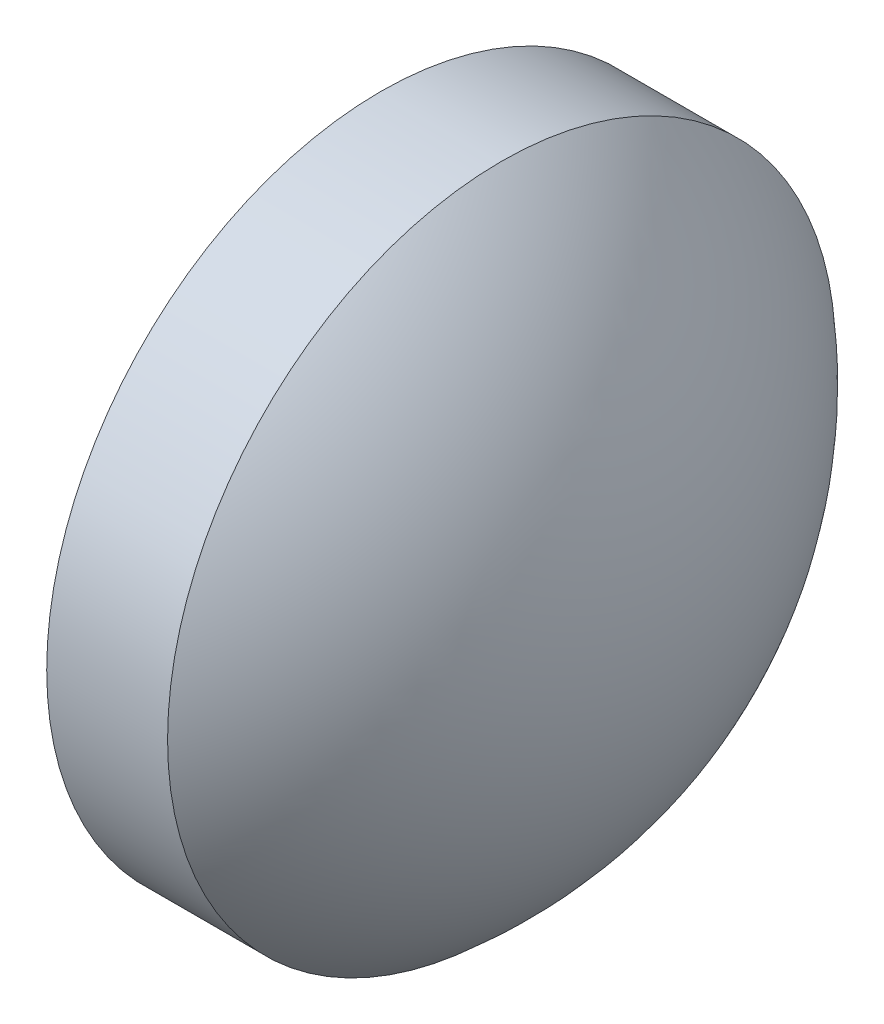
ISO-10303-21;
HEADER;
FILE_DESCRIPTION(('STEP AP214'),'2;1');
FILE_NAME('part.step','',(''),(''),'','','');
FILE_SCHEMA(('AUTOMOTIVE_DESIGN { 1 0 10303 214 1 1 1 1 }'));
ENDSEC;
DATA;
#1=APPLICATION_CONTEXT('core data for automotive mechanical design processes');
#2=APPLICATION_PROTOCOL_DEFINITION('international standard','automotive_design',2000,#1);
#3=PRODUCT_CONTEXT('',#1,'mechanical');
#4=PRODUCT('Part','Part','',(#3));
#5=PRODUCT_RELATED_PRODUCT_CATEGORY('part','',(#4));
#6=PRODUCT_DEFINITION_FORMATION('','',#4);
#7=PRODUCT_DEFINITION_CONTEXT('part definition',#1,'design');
#8=PRODUCT_DEFINITION('design','',#6,#7);
#9=PRODUCT_DEFINITION_SHAPE('','',#8);
#10=(LENGTH_UNIT() NAMED_UNIT(*) SI_UNIT(.MILLI.,.METRE.));
#11=(NAMED_UNIT(*) PLANE_ANGLE_UNIT() SI_UNIT($,.RADIAN.));
#12=(NAMED_UNIT(*) SI_UNIT($,.STERADIAN.) SOLID_ANGLE_UNIT());
#13=UNCERTAINTY_MEASURE_WITH_UNIT(LENGTH_MEASURE(1.E-05),#10,'distance_accuracy_value','');
#14=(GEOMETRIC_REPRESENTATION_CONTEXT(3) GLOBAL_UNCERTAINTY_ASSIGNED_CONTEXT((#13)) GLOBAL_UNIT_ASSIGNED_CONTEXT((#10,
#11,#12)) REPRESENTATION_CONTEXT('',''));
#15=CARTESIAN_POINT('',(0.,0.,0.));
#16=DIRECTION('',(0.,0.,1.));
#17=DIRECTION('',(1.,0.,0.));
#18=AXIS2_PLACEMENT_3D('',#15,#16,#17);
#19=CARTESIAN_POINT('',(428.801579864745,112.918675998957,0.));
#20=DIRECTION('',(-1.,0.,0.));
#21=DIRECTION('',(0.,1.,0.));
#22=AXIS2_PLACEMENT_3D('',#19,#20,#21);
#23=SPHERICAL_SURFACE('',#22,4.12811643835615);
#24=CARTESIAN_POINT('',(431.469696303101,112.918675998957,0.));
#25=DIRECTION('',(-1.,0.,0.));
#26=DIRECTION('',(0.,0.,1.));
#27=AXIS2_PLACEMENT_3D('',#24,#25,#26);
#28=CIRCLE('',#27,3.15000000000001);
#29=CARTESIAN_POINT('',(431.469696303101,112.918675998957,3.15000000000001));
#30=VERTEX_POINT('',#29);
#31=EDGE_CURVE('E10',#30,#30,#28,.T.);
#32=ORIENTED_EDGE('',*,*,#31,.F.);
#33=EDGE_LOOP('',(#32));
#34=FACE_BOUND('',#33,.T.);
#35=ADVANCED_FACE('F35',(#34),#23,.T.);
#36=CARTESIAN_POINT('',(429.468068133517,112.918675998957,0.));
#37=DIRECTION('',(-1.,0.,0.));
#38=DIRECTION('',(0.,0.,1.));
#39=AXIS2_PLACEMENT_3D('',#36,#37,#38);
#40=CYLINDRICAL_SURFACE('',#39,3.15000000000001);
#41=CARTESIAN_POINT('',(430.329696303101,112.918675998957,0.));
#42=DIRECTION('',(-1.,0.,0.));
#43=DIRECTION('',(0.,0.,1.));
#44=AXIS2_PLACEMENT_3D('',#41,#42,#43);
#45=CIRCLE('',#44,3.15000000000001);
#46=CARTESIAN_POINT('',(430.329696303101,112.918675998957,3.15000000000001));
#47=VERTEX_POINT('',#46);
#48=EDGE_CURVE('E41',#47,#47,#45,.T.);
#49=ORIENTED_EDGE('',*,*,#48,.F.);
#50=EDGE_LOOP('',(#49));
#51=FACE_BOUND('',#50,.T.);
#52=ORIENTED_EDGE('',*,*,#31,.T.);
#53=EDGE_LOOP('',(#52));
#54=FACE_BOUND('',#53,.T.);
#55=ADVANCED_FACE('F49',(#51,#54),#40,.T.);
#56=CARTESIAN_POINT('',(430.329696303101,112.918675998957,0.));
#57=DIRECTION('',(1.,0.,0.));
#58=DIRECTION('',(0.,0.,-1.));
#59=AXIS2_PLACEMENT_3D('',#56,#57,#58);
#60=PLANE('',#59);
#61=ORIENTED_EDGE('',*,*,#48,.T.);
#62=EDGE_LOOP('',(#61));
#63=FACE_BOUND('',#62,.T.);
#64=ADVANCED_FACE('F47',(#63),#60,.F.);
#65=CLOSED_SHELL('',(#35,#55,#64));
#66=MANIFOLD_SOLID_BREP('B2',#65);
#67=ADVANCED_BREP_SHAPE_REPRESENTATION('',(#18,#66),#14);
#68=SHAPE_DEFINITION_REPRESENTATION(#9,#67);
ENDSEC;
END-ISO-10303-21;
